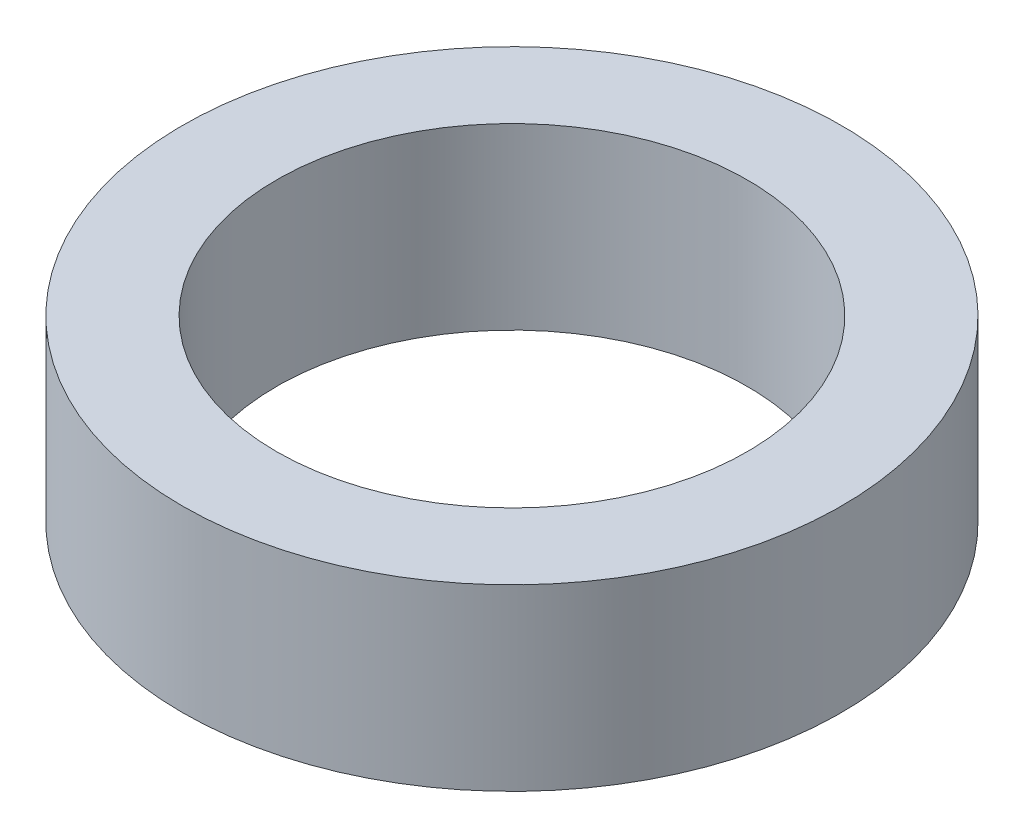
ISO-10303-21;
HEADER;
FILE_DESCRIPTION(('STEP AP214'),'2;1');
FILE_NAME('part.step','',(''),(''),'','','');
FILE_SCHEMA(('AUTOMOTIVE_DESIGN { 1 0 10303 214 1 1 1 1 }'));
ENDSEC;
DATA;
#1=APPLICATION_CONTEXT('core data for automotive mechanical design processes');
#2=APPLICATION_PROTOCOL_DEFINITION('international standard','automotive_design',2000,#1);
#3=PRODUCT_CONTEXT('',#1,'mechanical');
#4=PRODUCT('Part','Part','',(#3));
#5=PRODUCT_RELATED_PRODUCT_CATEGORY('part','',(#4));
#6=PRODUCT_DEFINITION_FORMATION('','',#4);
#7=PRODUCT_DEFINITION_CONTEXT('part definition',#1,'design');
#8=PRODUCT_DEFINITION('design','',#6,#7);
#9=PRODUCT_DEFINITION_SHAPE('','',#8);
#10=(LENGTH_UNIT() NAMED_UNIT(*) SI_UNIT(.MILLI.,.METRE.));
#11=(NAMED_UNIT(*) PLANE_ANGLE_UNIT() SI_UNIT($,.RADIAN.));
#12=(NAMED_UNIT(*) SI_UNIT($,.STERADIAN.) SOLID_ANGLE_UNIT());
#13=UNCERTAINTY_MEASURE_WITH_UNIT(LENGTH_MEASURE(1.E-05),#10,'distance_accuracy_value','');
#14=(GEOMETRIC_REPRESENTATION_CONTEXT(3) GLOBAL_UNCERTAINTY_ASSIGNED_CONTEXT((#13)) GLOBAL_UNIT_ASSIGNED_CONTEXT((#10,
#11,#12)) REPRESENTATION_CONTEXT('',''));
#15=CARTESIAN_POINT('',(0.,0.,0.));
#16=DIRECTION('',(0.,0.,1.));
#17=DIRECTION('',(1.,0.,0.));
#18=AXIS2_PLACEMENT_3D('',#15,#16,#17);
#19=CARTESIAN_POINT('',(0.,19.,0.));
#20=DIRECTION('',(0.,-1.,0.));
#21=DIRECTION('',(0.,0.,-1.));
#22=AXIS2_PLACEMENT_3D('',#19,#20,#21);
#23=CYLINDRICAL_SURFACE('',#22,35.);
#24=CARTESIAN_POINT('',(0.,19.,0.));
#25=DIRECTION('',(0.,1.,0.));
#26=DIRECTION('',(0.,0.,1.));
#27=AXIS2_PLACEMENT_3D('',#24,#25,#26);
#28=CIRCLE('',#27,35.);
#29=CARTESIAN_POINT('',(0.,19.,35.));
#30=VERTEX_POINT('',#29);
#31=EDGE_CURVE('E10',#30,#30,#28,.T.);
#32=ORIENTED_EDGE('',*,*,#31,.F.);
#33=EDGE_LOOP('',(#32));
#34=FACE_BOUND('',#33,.T.);
#35=CARTESIAN_POINT('',(0.,0.,0.));
#36=DIRECTION('',(0.,1.,0.));
#37=DIRECTION('',(0.,0.,1.));
#38=AXIS2_PLACEMENT_3D('',#35,#36,#37);
#39=CIRCLE('',#38,35.);
#40=CARTESIAN_POINT('',(0.,0.,35.));
#41=VERTEX_POINT('',#40);
#42=EDGE_CURVE('E37',#41,#41,#39,.T.);
#43=ORIENTED_EDGE('',*,*,#42,.T.);
#44=EDGE_LOOP('',(#43));
#45=FACE_BOUND('',#44,.T.);
#46=ADVANCED_FACE('F40',(#34,#45),#23,.T.);
#47=CARTESIAN_POINT('',(0.,19.,0.));
#48=DIRECTION('',(0.,1.,0.));
#49=DIRECTION('',(0.,0.,1.));
#50=AXIS2_PLACEMENT_3D('',#47,#48,#49);
#51=PLANE('',#50);
#52=CARTESIAN_POINT('',(0.,19.,0.));
#53=DIRECTION('',(0.,1.,0.));
#54=DIRECTION('',(0.,0.,1.));
#55=AXIS2_PLACEMENT_3D('',#52,#53,#54);
#56=CIRCLE('',#55,25.);
#57=CARTESIAN_POINT('',(0.,19.,25.));
#58=VERTEX_POINT('',#57);
#59=EDGE_CURVE('E50',#58,#58,#56,.T.);
#60=ORIENTED_EDGE('',*,*,#59,.F.);
#61=EDGE_LOOP('',(#60));
#62=FACE_BOUND('',#61,.T.);
#63=ORIENTED_EDGE('',*,*,#31,.T.);
#64=EDGE_LOOP('',(#63));
#65=FACE_BOUND('',#64,.T.);
#66=ADVANCED_FACE('F59',(#62,#65),#51,.T.);
#67=CARTESIAN_POINT('',(0.,0.,0.));
#68=DIRECTION('',(0.,1.,0.));
#69=DIRECTION('',(0.,0.,1.));
#70=AXIS2_PLACEMENT_3D('',#67,#68,#69);
#71=PLANE('',#70);
#72=CARTESIAN_POINT('',(0.,0.,0.));
#73=DIRECTION('',(0.,1.,0.));
#74=DIRECTION('',(0.,0.,1.));
#75=AXIS2_PLACEMENT_3D('',#72,#73,#74);
#76=CIRCLE('',#75,25.);
#77=CARTESIAN_POINT('',(0.,0.,25.));
#78=VERTEX_POINT('',#77);
#79=EDGE_CURVE('E47',#78,#78,#76,.T.);
#80=ORIENTED_EDGE('',*,*,#79,.T.);
#81=EDGE_LOOP('',(#80));
#82=FACE_BOUND('',#81,.T.);
#83=ORIENTED_EDGE('',*,*,#42,.F.);
#84=EDGE_LOOP('',(#83));
#85=FACE_BOUND('',#84,.T.);
#86=ADVANCED_FACE('F58',(#82,#85),#71,.F.);
#87=CARTESIAN_POINT('',(0.,19.,0.));
#88=DIRECTION('',(0.,-1.,0.));
#89=DIRECTION('',(0.,0.,-1.));
#90=AXIS2_PLACEMENT_3D('',#87,#88,#89);
#91=CYLINDRICAL_SURFACE('',#90,25.);
#92=ORIENTED_EDGE('',*,*,#59,.T.);
#93=EDGE_LOOP('',(#92));
#94=FACE_BOUND('',#93,.T.);
#95=ORIENTED_EDGE('',*,*,#79,.F.);
#96=EDGE_LOOP('',(#95));
#97=FACE_BOUND('',#96,.T.);
#98=ADVANCED_FACE('F54',(#94,#97),#91,.F.);
#99=CLOSED_SHELL('',(#46,#66,#86,#98));
#100=MANIFOLD_SOLID_BREP('B2',#99);
#101=ADVANCED_BREP_SHAPE_REPRESENTATION('',(#18,#100),#14);
#102=SHAPE_DEFINITION_REPRESENTATION(#9,#101);
ENDSEC;
END-ISO-10303-21;
